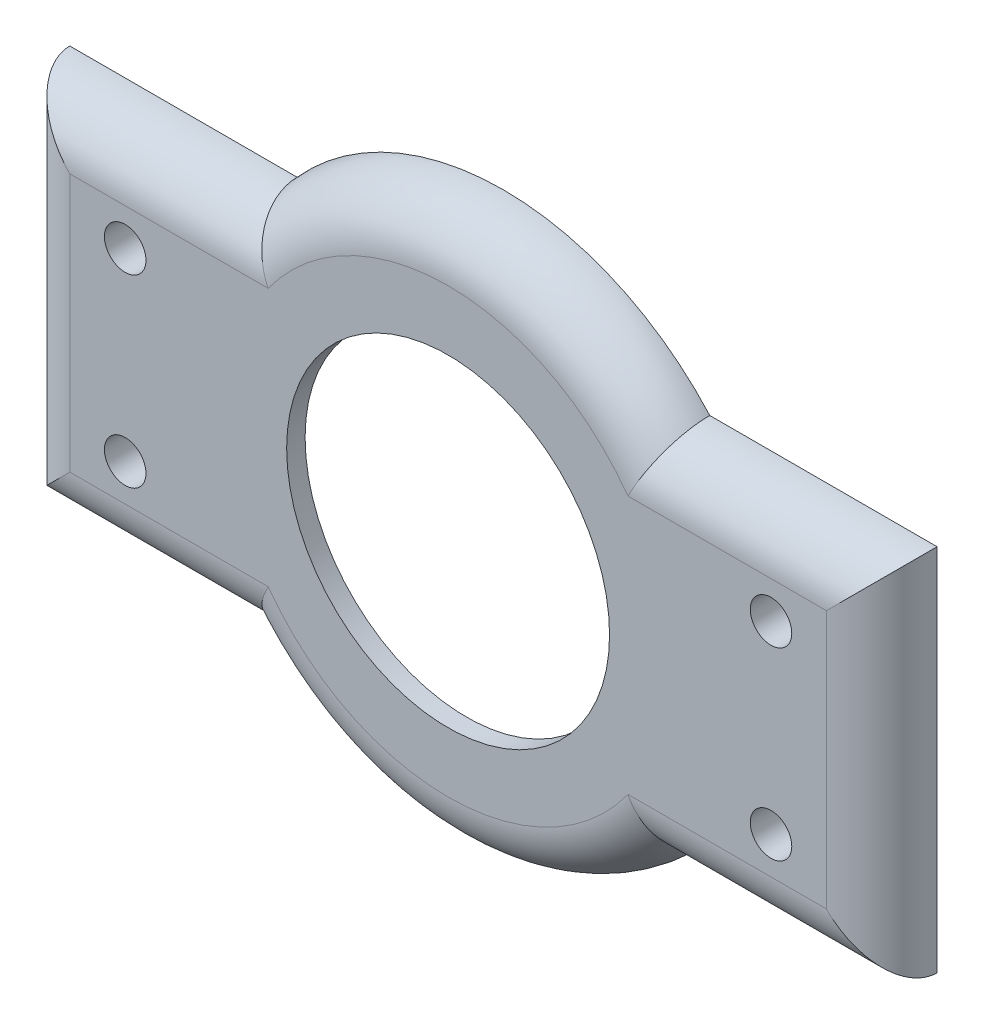
ISO-10303-21;
HEADER;
FILE_DESCRIPTION(('STEP AP214'),'2;1');
FILE_NAME('part.step','',(''),(''),'','','');
FILE_SCHEMA(('AUTOMOTIVE_DESIGN { 1 0 10303 214 1 1 1 1 }'));
ENDSEC;
DATA;
#1=APPLICATION_CONTEXT('core data for automotive mechanical design processes');
#2=APPLICATION_PROTOCOL_DEFINITION('international standard','automotive_design',2000,#1);
#3=PRODUCT_CONTEXT('',#1,'mechanical');
#4=PRODUCT('Part','Part','',(#3));
#5=PRODUCT_RELATED_PRODUCT_CATEGORY('part','',(#4));
#6=PRODUCT_DEFINITION_FORMATION('','',#4);
#7=PRODUCT_DEFINITION_CONTEXT('part definition',#1,'design');
#8=PRODUCT_DEFINITION('design','',#6,#7);
#9=PRODUCT_DEFINITION_SHAPE('','',#8);
#10=(LENGTH_UNIT() NAMED_UNIT(*) SI_UNIT(.MILLI.,.METRE.));
#11=(NAMED_UNIT(*) PLANE_ANGLE_UNIT() SI_UNIT($,.RADIAN.));
#12=(NAMED_UNIT(*) SI_UNIT($,.STERADIAN.) SOLID_ANGLE_UNIT());
#13=UNCERTAINTY_MEASURE_WITH_UNIT(LENGTH_MEASURE(1.E-05),#10,'distance_accuracy_value','');
#14=(GEOMETRIC_REPRESENTATION_CONTEXT(3) GLOBAL_UNCERTAINTY_ASSIGNED_CONTEXT((#13)) GLOBAL_UNIT_ASSIGNED_CONTEXT((#10,
#11,#12)) REPRESENTATION_CONTEXT('',''));
#15=CARTESIAN_POINT('',(0.,0.,0.));
#16=DIRECTION('',(0.,0.,1.));
#17=DIRECTION('',(1.,0.,0.));
#18=AXIS2_PLACEMENT_3D('',#15,#16,#17);
#19=CARTESIAN_POINT('',(0.,0.,2.));
#20=DIRECTION('',(0.,0.,1.));
#21=DIRECTION('',(1.,0.,0.));
#22=AXIS2_PLACEMENT_3D('',#19,#20,#21);
#23=PLANE('',#22);
#24=CARTESIAN_POINT('',(-35.,10.,2.));
#25=DIRECTION('',(0.,0.,1.));
#26=DIRECTION('',(1.,0.,0.));
#27=AXIS2_PLACEMENT_3D('',#24,#25,#26);
#28=CIRCLE('',#27,2.25);
#29=CARTESIAN_POINT('',(-32.75,10.,2.));
#30=VERTEX_POINT('',#29);
#31=EDGE_CURVE('E241',#30,#30,#28,.T.);
#32=ORIENTED_EDGE('',*,*,#31,.F.);
#33=EDGE_LOOP('',(#32));
#34=FACE_BOUND('',#33,.T.);
#35=CARTESIAN_POINT('',(-35.,-10.,2.));
#36=DIRECTION('',(0.,0.,1.));
#37=DIRECTION('',(1.,0.,0.));
#38=AXIS2_PLACEMENT_3D('',#35,#36,#37);
#39=CIRCLE('',#38,2.25);
#40=CARTESIAN_POINT('',(-32.75,-10.,2.));
#41=VERTEX_POINT('',#40);
#42=EDGE_CURVE('E245',#41,#41,#39,.T.);
#43=ORIENTED_EDGE('',*,*,#42,.F.);
#44=EDGE_LOOP('',(#43));
#45=FACE_BOUND('',#44,.T.);
#46=CARTESIAN_POINT('',(35.,10.,2.));
#47=DIRECTION('',(0.,0.,1.));
#48=DIRECTION('',(1.,0.,0.));
#49=AXIS2_PLACEMENT_3D('',#46,#47,#48);
#50=CIRCLE('',#49,2.25);
#51=CARTESIAN_POINT('',(37.25,10.,2.));
#52=VERTEX_POINT('',#51);
#53=EDGE_CURVE('E255',#52,#52,#50,.T.);
#54=ORIENTED_EDGE('',*,*,#53,.F.);
#55=EDGE_LOOP('',(#54));
#56=FACE_BOUND('',#55,.T.);
#57=CARTESIAN_POINT('',(35.,-10.,2.));
#58=DIRECTION('',(0.,0.,1.));
#59=DIRECTION('',(1.,0.,0.));
#60=AXIS2_PLACEMENT_3D('',#57,#58,#59);
#61=CIRCLE('',#60,2.25);
#62=CARTESIAN_POINT('',(37.25,-10.,2.));
#63=VERTEX_POINT('',#62);
#64=EDGE_CURVE('E263',#63,#63,#61,.T.);
#65=ORIENTED_EDGE('',*,*,#64,.F.);
#66=EDGE_LOOP('',(#65));
#67=FACE_BOUND('',#66,.T.);
#68=DIRECTION('',(-1.,0.,0.));
#69=VECTOR('',#68,1.);
#70=CARTESIAN_POINT('',(0.,-14.,2.));
#71=LINE('',#70,#69);
#72=CARTESIAN_POINT('',(19.4935886896179,-14.,2.));
#73=VERTEX_POINT('',#72);
#74=CARTESIAN_POINT('',(41.,-14.,2.));
#75=VERTEX_POINT('',#74);
#76=EDGE_CURVE('E54',#73,#75,#71,.F.);
#77=ORIENTED_EDGE('',*,*,#76,.T.);
#78=DIRECTION('',(0.,-1.,0.));
#79=VECTOR('',#78,1.);
#80=CARTESIAN_POINT('',(41.,0.,2.));
#81=LINE('',#80,#79);
#82=CARTESIAN_POINT('',(41.,14.,2.));
#83=VERTEX_POINT('',#82);
#84=EDGE_CURVE('E11',#75,#83,#81,.F.);
#85=ORIENTED_EDGE('',*,*,#84,.T.);
#86=DIRECTION('',(1.,0.,0.));
#87=VECTOR('',#86,1.);
#88=CARTESIAN_POINT('',(0.,14.,2.));
#89=LINE('',#88,#87);
#90=CARTESIAN_POINT('',(19.4935886896179,14.,2.));
#91=VERTEX_POINT('',#90);
#92=EDGE_CURVE('E309',#83,#91,#89,.F.);
#93=ORIENTED_EDGE('',*,*,#92,.T.);
#94=CARTESIAN_POINT('',(0.,0.,2.));
#95=DIRECTION('',(0.,0.,1.));
#96=DIRECTION('',(1.,0.,0.));
#97=AXIS2_PLACEMENT_3D('',#94,#95,#96);
#98=CIRCLE('',#97,24.);
#99=CARTESIAN_POINT('',(-19.4935886896179,14.,2.));
#100=VERTEX_POINT('',#99);
#101=EDGE_CURVE('E306',#91,#100,#98,.T.);
#102=ORIENTED_EDGE('',*,*,#101,.T.);
#103=DIRECTION('',(1.,0.,0.));
#104=VECTOR('',#103,1.);
#105=CARTESIAN_POINT('',(0.,14.,2.));
#106=LINE('',#105,#104);
#107=CARTESIAN_POINT('',(-41.,14.,2.));
#108=VERTEX_POINT('',#107);
#109=EDGE_CURVE('E295',#100,#108,#106,.F.);
#110=ORIENTED_EDGE('',*,*,#109,.T.);
#111=DIRECTION('',(0.,1.,0.));
#112=VECTOR('',#111,1.);
#113=CARTESIAN_POINT('',(-41.,0.,2.));
#114=LINE('',#113,#112);
#115=CARTESIAN_POINT('',(-41.,-14.,2.));
#116=VERTEX_POINT('',#115);
#117=EDGE_CURVE('E298',#108,#116,#114,.F.);
#118=ORIENTED_EDGE('',*,*,#117,.T.);
#119=DIRECTION('',(-1.,0.,0.));
#120=VECTOR('',#119,1.);
#121=CARTESIAN_POINT('',(0.,-14.,2.));
#122=LINE('',#121,#120);
#123=CARTESIAN_POINT('',(-19.4935886896179,-14.,2.));
#124=VERTEX_POINT('',#123);
#125=EDGE_CURVE('E138',#116,#124,#122,.F.);
#126=ORIENTED_EDGE('',*,*,#125,.T.);
#127=CARTESIAN_POINT('',(0.,0.,2.));
#128=DIRECTION('',(0.,0.,1.));
#129=DIRECTION('',(1.,0.,0.));
#130=AXIS2_PLACEMENT_3D('',#127,#128,#129);
#131=CIRCLE('',#130,24.);
#132=EDGE_CURVE('E303',#124,#73,#131,.T.);
#133=ORIENTED_EDGE('',*,*,#132,.T.);
#134=EDGE_LOOP('',(#77,#85,#93,#102,#110,#118,#126,#133));
#135=FACE_BOUND('',#134,.T.);
#136=CARTESIAN_POINT('',(0.,0.,2.00000000000003));
#137=DIRECTION('',(0.,0.,-1.));
#138=DIRECTION('',(-1.,0.,0.));
#139=AXIS2_PLACEMENT_3D('',#136,#137,#138);
#140=CIRCLE('',#139,17.5);
#141=CARTESIAN_POINT('',(-17.5,0.,2.00000000000003));
#142=VERTEX_POINT('',#141);
#143=EDGE_CURVE('E135',#142,#142,#140,.T.);
#144=ORIENTED_EDGE('',*,*,#143,.T.);
#145=EDGE_LOOP('',(#144));
#146=FACE_BOUND('',#145,.T.);
#147=ADVANCED_FACE('F44',(#34,#45,#56,#67,#135,#146),#23,.T.);
#148=CARTESIAN_POINT('',(0.,0.,-4.));
#149=DIRECTION('',(0.,0.,-1.));
#150=DIRECTION('',(-1.,0.,0.));
#151=AXIS2_PLACEMENT_3D('',#148,#149,#150);
#152=PLANE('',#151);
#153=CARTESIAN_POINT('',(-35.,10.,-4.));
#154=DIRECTION('',(0.,0.,-1.));
#155=DIRECTION('',(-1.,0.,0.));
#156=AXIS2_PLACEMENT_3D('',#153,#154,#155);
#157=CIRCLE('',#156,2.25);
#158=CARTESIAN_POINT('',(-37.25,10.,-4.));
#159=VERTEX_POINT('',#158);
#160=EDGE_CURVE('E238',#159,#159,#157,.T.);
#161=ORIENTED_EDGE('',*,*,#160,.F.);
#162=EDGE_LOOP('',(#161));
#163=FACE_BOUND('',#162,.T.);
#164=CARTESIAN_POINT('',(-35.,-10.,-4.));
#165=DIRECTION('',(0.,0.,-1.));
#166=DIRECTION('',(-1.,0.,0.));
#167=AXIS2_PLACEMENT_3D('',#164,#165,#166);
#168=CIRCLE('',#167,2.25);
#169=CARTESIAN_POINT('',(-37.25,-10.,-4.));
#170=VERTEX_POINT('',#169);
#171=EDGE_CURVE('E251',#170,#170,#168,.T.);
#172=ORIENTED_EDGE('',*,*,#171,.F.);
#173=EDGE_LOOP('',(#172));
#174=FACE_BOUND('',#173,.T.);
#175=CARTESIAN_POINT('',(35.,10.,-4.));
#176=DIRECTION('',(0.,0.,-1.));
#177=DIRECTION('',(-1.,0.,0.));
#178=AXIS2_PLACEMENT_3D('',#175,#176,#177);
#179=CIRCLE('',#178,2.25);
#180=CARTESIAN_POINT('',(32.75,10.,-4.));
#181=VERTEX_POINT('',#180);
#182=EDGE_CURVE('E259',#181,#181,#179,.T.);
#183=ORIENTED_EDGE('',*,*,#182,.F.);
#184=EDGE_LOOP('',(#183));
#185=FACE_BOUND('',#184,.T.);
#186=CARTESIAN_POINT('',(35.,-10.,-4.));
#187=DIRECTION('',(0.,0.,-1.));
#188=DIRECTION('',(-1.,0.,0.));
#189=AXIS2_PLACEMENT_3D('',#186,#187,#188);
#190=CIRCLE('',#189,2.25);
#191=CARTESIAN_POINT('',(32.75,-10.,-4.));
#192=VERTEX_POINT('',#191);
#193=EDGE_CURVE('E267',#192,#192,#190,.T.);
#194=ORIENTED_EDGE('',*,*,#193,.F.);
#195=EDGE_LOOP('',(#194));
#196=FACE_BOUND('',#195,.T.);
#197=CARTESIAN_POINT('',(0.,0.,-4.));
#198=DIRECTION('',(0.,0.,-1.));
#199=DIRECTION('',(-1.,0.,0.));
#200=AXIS2_PLACEMENT_3D('',#197,#198,#199);
#201=CIRCLE('',#200,25.);
#202=CARTESIAN_POINT('',(-25.,0.,-4.));
#203=VERTEX_POINT('',#202);
#204=EDGE_CURVE('E285',#203,#203,#201,.T.);
#205=ORIENTED_EDGE('',*,*,#204,.F.);
#206=EDGE_LOOP('',(#205));
#207=FACE_BOUND('',#206,.T.);
#208=CARTESIAN_POINT('',(0.,0.,-4.));
#209=DIRECTION('',(0.,0.,-1.));
#210=DIRECTION('',(-1.,0.,0.));
#211=AXIS2_PLACEMENT_3D('',#208,#209,#210);
#212=CIRCLE('',#211,30.);
#213=CARTESIAN_POINT('',(-22.3606797749979,20.,-4.));
#214=VERTEX_POINT('',#213);
#215=CARTESIAN_POINT('',(22.3606797749979,20.,-4.));
#216=VERTEX_POINT('',#215);
#217=EDGE_CURVE('E292',#214,#216,#212,.T.);
#218=ORIENTED_EDGE('',*,*,#217,.T.);
#219=DIRECTION('',(1.,0.,0.));
#220=VECTOR('',#219,1.);
#221=CARTESIAN_POINT('',(47.,20.,-4.));
#222=LINE('',#221,#220);
#223=CARTESIAN_POINT('',(47.,20.,-4.));
#224=VERTEX_POINT('',#223);
#225=EDGE_CURVE('E134',#216,#224,#222,.T.);
#226=ORIENTED_EDGE('',*,*,#225,.T.);
#227=DIRECTION('',(0.,-1.,0.));
#228=VECTOR('',#227,1.);
#229=CARTESIAN_POINT('',(47.,-20.,-4.));
#230=LINE('',#229,#228);
#231=CARTESIAN_POINT('',(47.,-20.,-4.));
#232=VERTEX_POINT('',#231);
#233=EDGE_CURVE('E124',#224,#232,#230,.T.);
#234=ORIENTED_EDGE('',*,*,#233,.T.);
#235=DIRECTION('',(-1.,0.,0.));
#236=VECTOR('',#235,1.);
#237=CARTESIAN_POINT('',(47.,-20.,-4.));
#238=LINE('',#237,#236);
#239=CARTESIAN_POINT('',(22.3606797749979,-20.,-4.));
#240=VERTEX_POINT('',#239);
#241=EDGE_CURVE('E123',#232,#240,#238,.T.);
#242=ORIENTED_EDGE('',*,*,#241,.T.);
#243=CARTESIAN_POINT('',(-22.3606797749979,-20.,-4.));
#244=VERTEX_POINT('',#243);
#245=EDGE_CURVE('E117',#240,#244,#212,.T.);
#246=ORIENTED_EDGE('',*,*,#245,.T.);
#247=CARTESIAN_POINT('',(-47.,-20.,-4.));
#248=VERTEX_POINT('',#247);
#249=EDGE_CURVE('E111',#244,#248,#238,.T.);
#250=ORIENTED_EDGE('',*,*,#249,.T.);
#251=DIRECTION('',(0.,1.,0.));
#252=VECTOR('',#251,1.);
#253=CARTESIAN_POINT('',(-47.,-20.,-4.));
#254=LINE('',#253,#252);
#255=CARTESIAN_POINT('',(-47.,20.,-4.));
#256=VERTEX_POINT('',#255);
#257=EDGE_CURVE('E114',#248,#256,#254,.T.);
#258=ORIENTED_EDGE('',*,*,#257,.T.);
#259=EDGE_CURVE('E282',#256,#214,#222,.T.);
#260=ORIENTED_EDGE('',*,*,#259,.T.);
#261=EDGE_LOOP('',(#218,#226,#234,#242,#246,#250,#258,#260));
#262=FACE_BOUND('',#261,.T.);
#263=ADVANCED_FACE('F113',(#163,#174,#185,#196,#207,#262),#152,.T.);
#264=CARTESIAN_POINT('',(0.,0.,-4.));
#265=DIRECTION('',(0.,0.,1.));
#266=DIRECTION('',(1.,0.,0.));
#267=AXIS2_PLACEMENT_3D('',#264,#265,#266);
#268=CYLINDRICAL_SURFACE('',#267,25.);
#269=ORIENTED_EDGE('',*,*,#204,.T.);
#270=EDGE_LOOP('',(#269));
#271=FACE_BOUND('',#270,.T.);
#272=CARTESIAN_POINT('',(0.,0.,0.));
#273=DIRECTION('',(0.,0.,-1.));
#274=DIRECTION('',(-1.,0.,0.));
#275=AXIS2_PLACEMENT_3D('',#272,#273,#274);
#276=CIRCLE('',#275,25.);
#277=CARTESIAN_POINT('',(-25.,0.,0.));
#278=VERTEX_POINT('',#277);
#279=EDGE_CURVE('E278',#278,#278,#276,.T.);
#280=ORIENTED_EDGE('',*,*,#279,.F.);
#281=EDGE_LOOP('',(#280));
#282=FACE_BOUND('',#281,.T.);
#283=ADVANCED_FACE('F205',(#271,#282),#268,.F.);
#284=CARTESIAN_POINT('',(0.,0.,0.));
#285=DIRECTION('',(0.,0.,1.));
#286=DIRECTION('',(1.,0.,0.));
#287=AXIS2_PLACEMENT_3D('',#284,#285,#286);
#288=PLANE('',#287);
#289=CARTESIAN_POINT('',(0.,0.,0.));
#290=DIRECTION('',(0.,0.,-1.));
#291=DIRECTION('',(-1.,0.,0.));
#292=AXIS2_PLACEMENT_3D('',#289,#290,#291);
#293=CIRCLE('',#292,17.5);
#294=CARTESIAN_POINT('',(-17.5,0.,0.));
#295=VERTEX_POINT('',#294);
#296=EDGE_CURVE('E144',#295,#295,#293,.T.);
#297=ORIENTED_EDGE('',*,*,#296,.F.);
#298=EDGE_LOOP('',(#297));
#299=FACE_BOUND('',#298,.T.);
#300=ORIENTED_EDGE('',*,*,#279,.T.);
#301=EDGE_LOOP('',(#300));
#302=FACE_BOUND('',#301,.T.);
#303=ADVANCED_FACE('F201',(#299,#302),#288,.F.);
#304=CARTESIAN_POINT('',(0.,0.,2.00000000000003));
#305=DIRECTION('',(0.,0.,-1.));
#306=DIRECTION('',(-1.,0.,0.));
#307=AXIS2_PLACEMENT_3D('',#304,#305,#306);
#308=CYLINDRICAL_SURFACE('',#307,17.5);
#309=ORIENTED_EDGE('',*,*,#143,.F.);
#310=EDGE_LOOP('',(#309));
#311=FACE_BOUND('',#310,.T.);
#312=ORIENTED_EDGE('',*,*,#296,.T.);
#313=EDGE_LOOP('',(#312));
#314=FACE_BOUND('',#313,.T.);
#315=ADVANCED_FACE('F204',(#311,#314),#308,.F.);
#316=CARTESIAN_POINT('',(-41.,-20.,-4.));
#317=DIRECTION('',(0.,1.,0.));
#318=DIRECTION('',(0.,0.,1.));
#319=AXIS2_PLACEMENT_3D('',#316,#317,#318);
#320=CYLINDRICAL_SURFACE('',#319,6.);
#321=CARTESIAN_POINT('',(-41.,-14.,-4.));
#322=DIRECTION('',(-0.707106781186547,0.707106781186547,0.));
#323=DIRECTION('',(0.707106781186547,0.707106781186547,0.));
#324=AXIS2_PLACEMENT_3D('',#321,#322,#323);
#325=ELLIPSE('',#324,8.48528137423857,6.);
#326=EDGE_CURVE('E129',#116,#248,#325,.F.);
#327=ORIENTED_EDGE('',*,*,#326,.F.);
#328=ORIENTED_EDGE('',*,*,#117,.F.);
#329=CARTESIAN_POINT('',(-41.,14.,-4.));
#330=DIRECTION('',(0.707106781186547,0.707106781186547,0.));
#331=DIRECTION('',(0.707106781186547,-0.707106781186547,0.));
#332=AXIS2_PLACEMENT_3D('',#329,#330,#331);
#333=ELLIPSE('',#332,8.48528137423857,6.);
#334=EDGE_CURVE('E48',#256,#108,#333,.T.);
#335=ORIENTED_EDGE('',*,*,#334,.F.);
#336=ORIENTED_EDGE('',*,*,#257,.F.);
#337=EDGE_LOOP('',(#327,#328,#335,#336));
#338=FACE_BOUND('',#337,.T.);
#339=ADVANCED_FACE('F46',(#338),#320,.T.);
#340=CARTESIAN_POINT('',(47.,14.,-4.));
#341=DIRECTION('',(1.,0.,0.));
#342=DIRECTION('',(0.,0.,-1.));
#343=AXIS2_PLACEMENT_3D('',#340,#341,#342);
#344=CYLINDRICAL_SURFACE('',#343,6.);
#345=ORIENTED_EDGE('',*,*,#334,.T.);
#346=ORIENTED_EDGE('',*,*,#109,.F.);
#347=CARTESIAN_POINT('',(-22.3606797749979,20.,-4.));
#348=CARTESIAN_POINT('',(-22.3606885946868,20.0000246248411,-3.8421552052644));
#349=CARTESIAN_POINT('',(-22.3578946208042,19.9937723539707,-3.68431782060247));
#350=CARTESIAN_POINT('',(-22.3467659816735,19.9688946352079,-3.36984998464221));
#351=CARTESIAN_POINT('',(-22.3384324794666,19.9502717845575,-3.21321928697762));
#352=CARTESIAN_POINT('',(-22.3163215306498,19.9009046069552,-2.9027376627166));
#353=CARTESIAN_POINT('',(-22.3025598394186,19.8701953614595,-2.74888002690595));
#354=CARTESIAN_POINT('',(-22.2697136666972,19.7969937760329,-2.44457447554402));
#355=CARTESIAN_POINT('',(-22.2506290856713,19.7545012157596,-2.29412662381104));
#356=CARTESIAN_POINT('',(-22.2073087006702,19.6582045895661,-1.9977544183201));
#357=CARTESIAN_POINT('',(-22.183075687498,19.6044066521063,-1.85182766272716));
#358=CARTESIAN_POINT('',(-22.1296387585979,19.4860098874083,-1.56530631435557));
#359=CARTESIAN_POINT('',(-22.100432998967,19.4214070538535,-1.42471372322721));
#360=CARTESIAN_POINT('',(-22.0372832655125,19.2820428722381,-1.14977619202819));
#361=CARTESIAN_POINT('',(-22.0033394004845,19.2072817574316,-1.01543110859761));
#362=CARTESIAN_POINT('',(-21.9309502480705,19.0482634156329,-0.753694698315457));
#363=CARTESIAN_POINT('',(-21.8925032521829,18.9640025848766,-0.626306037803511));
#364=CARTESIAN_POINT('',(-21.81006943435,18.783868860479,-0.375192277558907));
#365=CARTESIAN_POINT('',(-21.7659437439989,18.6877087181069,-0.251718583062626));
#366=CARTESIAN_POINT('',(-21.6734924399382,18.4869066812776,-0.0135265858213059));
#367=CARTESIAN_POINT('',(-21.6251653105735,18.3822617268776,0.101188529030902));
#368=CARTESIAN_POINT('',(-21.4743637011181,18.0569107969631,0.431340688345207));
#369=CARTESIAN_POINT('',(-21.3660097099654,17.8246587141122,0.632964134834508));
#370=CARTESIAN_POINT('',(-21.1269204948331,17.3165670418239,1.01087006931773));
#371=CARTESIAN_POINT('',(-20.9950785299177,17.0387148777664,1.18371822278674));
#372=CARTESIAN_POINT('',(-20.719257115299,16.4634300807909,1.48053987909019));
#373=CARTESIAN_POINT('',(-20.5752695448377,16.1659843768813,1.60448036194777));
#374=CARTESIAN_POINT('',(-20.2793743453335,15.5615637855901,1.80189453622453));
#375=CARTESIAN_POINT('',(-20.1275296590345,15.2546707934992,1.87571761250212));
#376=CARTESIAN_POINT('',(-19.8180438644189,14.6365503036601,1.97431545107953));
#377=CARTESIAN_POINT('',(-19.660415129243,14.3253328528119,1.99918933026693));
#378=CARTESIAN_POINT('',(-19.498818843525,14.0101964652727,1.99999351599242));
#379=CARTESIAN_POINT('',(-19.4962039457782,14.0050980649796,2.00000001397718));
#380=CARTESIAN_POINT('',(-19.4935886896179,14.,2.));
#381=B_SPLINE_CURVE_WITH_KNOTS('',3,(#347,#348,#349,#350,#351,#352,#353,#354,#355,#356,#357,
#358,#359,#360,#361,#362,#363,#364,#365,#366,#367,#368,#369,#370,#371,#372,#373,#374,#375,#376,
#377,#378,#379,#380),.UNSPECIFIED.,.F.,.F.,(4,2,2,2,2,2,2,2,2,2,2,2,2,2,2,2,4),(0.,
0.473374539403875,0.946649723740478,1.41856121222911,1.89048152583675,2.36214667602337,
2.83398710288178,3.30581669719329,3.77782588851301,4.26508767936846,4.75252598352504,
5.72672161906379,6.78081230257462,7.83561344195162,8.88298355645046,9.92823066732191,
9.94542026148344),.UNSPECIFIED.);
#382=EDGE_CURVE('E140',#214,#100,#381,.T.);
#383=ORIENTED_EDGE('',*,*,#382,.F.);
#384=ORIENTED_EDGE('',*,*,#259,.F.);
#385=EDGE_LOOP('',(#345,#346,#383,#384));
#386=FACE_BOUND('',#385,.T.);
#387=ADVANCED_FACE('F162',(#386),#344,.T.);
#388=CARTESIAN_POINT('',(47.,-14.,-4.));
#389=DIRECTION('',(-1.,0.,0.));
#390=DIRECTION('',(0.,0.,1.));
#391=AXIS2_PLACEMENT_3D('',#388,#389,#390);
#392=CYLINDRICAL_SURFACE('',#391,6.);
#393=ORIENTED_EDGE('',*,*,#326,.T.);
#394=ORIENTED_EDGE('',*,*,#249,.F.);
#395=CARTESIAN_POINT('',(-22.3606797749979,-20.,-4.));
#396=CARTESIAN_POINT('',(-22.3606885946868,-20.0000246248411,-3.8421552052644));
#397=CARTESIAN_POINT('',(-22.3578946208042,-19.9937723539707,-3.68431782060247));
#398=CARTESIAN_POINT('',(-22.3467659816735,-19.9688946352079,-3.36984998464221));
#399=CARTESIAN_POINT('',(-22.3384324794666,-19.9502717845575,-3.21321928697762));
#400=CARTESIAN_POINT('',(-22.3163215306498,-19.9009046069552,-2.9027376627166));
#401=CARTESIAN_POINT('',(-22.3025598394186,-19.8701953614595,-2.74888002690594));
#402=CARTESIAN_POINT('',(-22.2697136666972,-19.7969937760329,-2.44457447554402));
#403=CARTESIAN_POINT('',(-22.2506290856713,-19.7545012157596,-2.29412662381104));
#404=CARTESIAN_POINT('',(-22.2073087006702,-19.6582045895661,-1.9977544183201));
#405=CARTESIAN_POINT('',(-22.183075687498,-19.6044066521063,-1.85182766272716));
#406=CARTESIAN_POINT('',(-22.1296387585979,-19.4860098874083,-1.56530631435557));
#407=CARTESIAN_POINT('',(-22.100432998967,-19.4214070538535,-1.42471372322721));
#408=CARTESIAN_POINT('',(-22.0372832655125,-19.2820428722381,-1.14977619202819));
#409=CARTESIAN_POINT('',(-22.0033394004845,-19.2072817574316,-1.01543110859761));
#410=CARTESIAN_POINT('',(-21.9309502480705,-19.0482634156329,-0.753694698315458));
#411=CARTESIAN_POINT('',(-21.8925032521829,-18.9640025848766,-0.626306037803511));
#412=CARTESIAN_POINT('',(-21.81006943435,-18.783868860479,-0.375192277558906));
#413=CARTESIAN_POINT('',(-21.7659437439989,-18.6877087181069,-0.251718583062626));
#414=CARTESIAN_POINT('',(-21.6734924399382,-18.4869066812776,-0.0135265858213052));
#415=CARTESIAN_POINT('',(-21.6251653105735,-18.3822617268776,0.101188529030902));
#416=CARTESIAN_POINT('',(-21.4743637011181,-18.0569107969631,0.431340688345207));
#417=CARTESIAN_POINT('',(-21.3660097099654,-17.8246587141122,0.632964134834509));
#418=CARTESIAN_POINT('',(-21.1269204948331,-17.3165670418239,1.01087006931773));
#419=CARTESIAN_POINT('',(-20.9950785299177,-17.0387148777664,1.18371822278674));
#420=CARTESIAN_POINT('',(-20.7192571152989,-16.4634300807909,1.48053987909019));
#421=CARTESIAN_POINT('',(-20.5752695448377,-16.1659843768813,1.60448036194777));
#422=CARTESIAN_POINT('',(-20.2793743453335,-15.5615637855901,1.80189453622453));
#423=CARTESIAN_POINT('',(-20.1275296590345,-15.2546707934992,1.87571761250212));
#424=CARTESIAN_POINT('',(-19.8180438644189,-14.6365503036602,1.97431545107953));
#425=CARTESIAN_POINT('',(-19.6604151292429,-14.325332852812,1.99918933026693));
#426=CARTESIAN_POINT('',(-19.498818843525,-14.0101964652727,1.99999351599242));
#427=CARTESIAN_POINT('',(-19.4962039457782,-14.0050980649796,2.00000001397718));
#428=CARTESIAN_POINT('',(-19.4935886896179,-14.,2.));
#429=B_SPLINE_CURVE_WITH_KNOTS('',3,(#395,#396,#397,#398,#399,#400,#401,#402,#403,#404,#405,
#406,#407,#408,#409,#410,#411,#412,#413,#414,#415,#416,#417,#418,#419,#420,#421,#422,#423,#424,
#425,#426,#427,#428),.UNSPECIFIED.,.F.,.F.,(4,2,2,2,2,2,2,2,2,2,2,2,2,2,2,2,4),(0.,
0.473374539403875,0.946649723740479,1.41856121222912,1.89048152583675,2.36214667602337,
2.83398710288178,3.30581669719328,3.77782588851301,4.26508767936846,4.75252598352504,
5.72672161906379,6.78081230257463,7.83561344195162,8.88298355645046,9.92823066732191,
9.94542026148344),.UNSPECIFIED.);
#430=EDGE_CURVE('E147',#124,#244,#429,.F.);
#431=ORIENTED_EDGE('',*,*,#430,.F.);
#432=ORIENTED_EDGE('',*,*,#125,.F.);
#433=EDGE_LOOP('',(#393,#394,#431,#432));
#434=FACE_BOUND('',#433,.T.);
#435=ADVANCED_FACE('F137',(#434),#392,.T.);
#436=CARTESIAN_POINT('',(0.,0.,-4.));
#437=DIRECTION('',(0.,0.,1.));
#438=DIRECTION('',(1.,0.,0.));
#439=AXIS2_PLACEMENT_3D('',#436,#437,#438);
#440=TOROIDAL_SURFACE('',#439,24.,6.);
#441=ORIENTED_EDGE('',*,*,#382,.T.);
#442=ORIENTED_EDGE('',*,*,#101,.F.);
#443=CARTESIAN_POINT('',(22.3606797749979,20.,-4.));
#444=CARTESIAN_POINT('',(22.3606885946868,20.0000246248411,-3.8421552052644));
#445=CARTESIAN_POINT('',(22.3578946208042,19.9937723539707,-3.68431782060247));
#446=CARTESIAN_POINT('',(22.3467659816735,19.9688946352079,-3.36984998464221));
#447=CARTESIAN_POINT('',(22.3384324794666,19.9502717845575,-3.21321928697762));
#448=CARTESIAN_POINT('',(22.3163215306498,19.9009046069552,-2.9027376627166));
#449=CARTESIAN_POINT('',(22.3025598394186,19.8701953614595,-2.74888002690594));
#450=CARTESIAN_POINT('',(22.2697136666972,19.7969937760329,-2.44457447554402));
#451=CARTESIAN_POINT('',(22.2506290856713,19.7545012157596,-2.29412662381104));
#452=CARTESIAN_POINT('',(22.2073087006702,19.6582045895661,-1.9977544183201));
#453=CARTESIAN_POINT('',(22.183075687498,19.6044066521063,-1.85182766272716));
#454=CARTESIAN_POINT('',(22.1296387585979,19.4860098874083,-1.56530631435557));
#455=CARTESIAN_POINT('',(22.100432998967,19.4214070538535,-1.42471372322721));
#456=CARTESIAN_POINT('',(22.0372832655125,19.2820428722381,-1.14977619202819));
#457=CARTESIAN_POINT('',(22.0033394004845,19.2072817574316,-1.01543110859761));
#458=CARTESIAN_POINT('',(21.9309502480705,19.0482634156329,-0.753694698315458));
#459=CARTESIAN_POINT('',(21.8925032521829,18.9640025848766,-0.626306037803511));
#460=CARTESIAN_POINT('',(21.81006943435,18.783868860479,-0.375192277558906));
#461=CARTESIAN_POINT('',(21.7659437439989,18.6877087181069,-0.251718583062626));
#462=CARTESIAN_POINT('',(21.6734924399382,18.4869066812776,-0.0135265858213052));
#463=CARTESIAN_POINT('',(21.6251653105735,18.3822617268776,0.101188529030902));
#464=CARTESIAN_POINT('',(21.4743637011181,18.0569107969631,0.431340688345207));
#465=CARTESIAN_POINT('',(21.3660097099654,17.8246587141122,0.632964134834509));
#466=CARTESIAN_POINT('',(21.1269204948331,17.3165670418239,1.01087006931773));
#467=CARTESIAN_POINT('',(20.9950785299177,17.0387148777664,1.18371822278674));
#468=CARTESIAN_POINT('',(20.7192571152989,16.4634300807909,1.48053987909019));
#469=CARTESIAN_POINT('',(20.5752695448377,16.1659843768813,1.60448036194777));
#470=CARTESIAN_POINT('',(20.2793743453335,15.5615637855901,1.80189453622453));
#471=CARTESIAN_POINT('',(20.1275296590345,15.2546707934992,1.87571761250212));
#472=CARTESIAN_POINT('',(19.8180438644189,14.6365503036602,1.97431545107953));
#473=CARTESIAN_POINT('',(19.6604151292429,14.325332852812,1.99918933026693));
#474=CARTESIAN_POINT('',(19.498818843525,14.0101964652727,1.99999351599242));
#475=CARTESIAN_POINT('',(19.4962039457782,14.0050980649796,2.00000001397718));
#476=CARTESIAN_POINT('',(19.4935886896179,14.,2.));
#477=B_SPLINE_CURVE_WITH_KNOTS('',3,(#443,#444,#445,#446,#447,#448,#449,#450,#451,#452,#453,
#454,#455,#456,#457,#458,#459,#460,#461,#462,#463,#464,#465,#466,#467,#468,#469,#470,#471,#472,
#473,#474,#475,#476),.UNSPECIFIED.,.F.,.F.,(4,2,2,2,2,2,2,2,2,2,2,2,2,2,2,2,4),(0.,
0.473374539403875,0.946649723740479,1.41856121222912,1.89048152583675,2.36214667602337,
2.83398710288178,3.30581669719328,3.77782588851301,4.26508767936846,4.75252598352504,
5.72672161906379,6.78081230257463,7.83561344195162,8.88298355645046,9.92823066732191,
9.94542026148344),.UNSPECIFIED.);
#478=EDGE_CURVE('E175',#216,#91,#477,.T.);
#479=ORIENTED_EDGE('',*,*,#478,.F.);
#480=ORIENTED_EDGE('',*,*,#217,.F.);
#481=EDGE_LOOP('',(#441,#442,#479,#480));
#482=FACE_BOUND('',#481,.T.);
#483=ADVANCED_FACE('F164',(#482),#440,.T.);
#484=CARTESIAN_POINT('',(0.,0.,-4.));
#485=DIRECTION('',(0.,0.,1.));
#486=DIRECTION('',(1.,0.,0.));
#487=AXIS2_PLACEMENT_3D('',#484,#485,#486);
#488=TOROIDAL_SURFACE('',#487,24.,6.);
#489=ORIENTED_EDGE('',*,*,#430,.T.);
#490=ORIENTED_EDGE('',*,*,#245,.F.);
#491=CARTESIAN_POINT('',(22.3606797749979,-20.,-4.));
#492=CARTESIAN_POINT('',(22.3606885946868,-20.0000246248411,-3.8421552052644));
#493=CARTESIAN_POINT('',(22.3578946208042,-19.9937723539707,-3.68431782060247));
#494=CARTESIAN_POINT('',(22.3467659816735,-19.9688946352079,-3.36984998464221));
#495=CARTESIAN_POINT('',(22.3384324794666,-19.9502717845575,-3.21321928697762));
#496=CARTESIAN_POINT('',(22.3163215306498,-19.9009046069552,-2.9027376627166));
#497=CARTESIAN_POINT('',(22.3025598394186,-19.8701953614595,-2.74888002690594));
#498=CARTESIAN_POINT('',(22.2697136666972,-19.7969937760329,-2.44457447554402));
#499=CARTESIAN_POINT('',(22.2506290856713,-19.7545012157596,-2.29412662381104));
#500=CARTESIAN_POINT('',(22.2073087006702,-19.6582045895661,-1.9977544183201));
#501=CARTESIAN_POINT('',(22.183075687498,-19.6044066521063,-1.85182766272716));
#502=CARTESIAN_POINT('',(22.1296387585979,-19.4860098874083,-1.56530631435557));
#503=CARTESIAN_POINT('',(22.100432998967,-19.4214070538535,-1.42471372322721));
#504=CARTESIAN_POINT('',(22.0372832655125,-19.2820428722381,-1.14977619202819));
#505=CARTESIAN_POINT('',(22.0033394004845,-19.2072817574316,-1.01543110859761));
#506=CARTESIAN_POINT('',(21.9309502480705,-19.0482634156329,-0.753694698315458));
#507=CARTESIAN_POINT('',(21.8925032521829,-18.9640025848766,-0.626306037803511));
#508=CARTESIAN_POINT('',(21.81006943435,-18.783868860479,-0.375192277558906));
#509=CARTESIAN_POINT('',(21.7659437439989,-18.6877087181069,-0.251718583062626));
#510=CARTESIAN_POINT('',(21.6734924399382,-18.4869066812776,-0.0135265858213052));
#511=CARTESIAN_POINT('',(21.6251653105735,-18.3822617268776,0.101188529030902));
#512=CARTESIAN_POINT('',(21.4743637011181,-18.0569107969631,0.431340688345207));
#513=CARTESIAN_POINT('',(21.3660097099654,-17.8246587141122,0.632964134834509));
#514=CARTESIAN_POINT('',(21.1269204948331,-17.3165670418239,1.01087006931773));
#515=CARTESIAN_POINT('',(20.9950785299177,-17.0387148777664,1.18371822278674));
#516=CARTESIAN_POINT('',(20.7192571152989,-16.4634300807909,1.48053987909019));
#517=CARTESIAN_POINT('',(20.5752695448377,-16.1659843768813,1.60448036194777));
#518=CARTESIAN_POINT('',(20.2793743453335,-15.5615637855901,1.80189453622453));
#519=CARTESIAN_POINT('',(20.1275296590345,-15.2546707934992,1.87571761250212));
#520=CARTESIAN_POINT('',(19.8180438644189,-14.6365503036602,1.97431545107953));
#521=CARTESIAN_POINT('',(19.6604151292429,-14.325332852812,1.99918933026693));
#522=CARTESIAN_POINT('',(19.498818843525,-14.0101964652727,1.99999351599242));
#523=CARTESIAN_POINT('',(19.4962039457782,-14.0050980649796,2.00000001397718));
#524=CARTESIAN_POINT('',(19.4935886896179,-14.,2.));
#525=B_SPLINE_CURVE_WITH_KNOTS('',3,(#491,#492,#493,#494,#495,#496,#497,#498,#499,#500,#501,
#502,#503,#504,#505,#506,#507,#508,#509,#510,#511,#512,#513,#514,#515,#516,#517,#518,#519,#520,
#521,#522,#523,#524),.UNSPECIFIED.,.F.,.F.,(4,2,2,2,2,2,2,2,2,2,2,2,2,2,2,2,4),(0.,
0.473374539403875,0.946649723740479,1.41856121222912,1.89048152583675,2.36214667602337,
2.83398710288178,3.30581669719328,3.77782588851301,4.26508767936846,4.75252598352504,
5.72672161906379,6.78081230257463,7.83561344195162,8.88298355645046,9.92823066732191,
9.94542026148344),.UNSPECIFIED.);
#526=EDGE_CURVE('E183',#73,#240,#525,.F.);
#527=ORIENTED_EDGE('',*,*,#526,.F.);
#528=ORIENTED_EDGE('',*,*,#132,.F.);
#529=EDGE_LOOP('',(#489,#490,#527,#528));
#530=FACE_BOUND('',#529,.T.);
#531=ADVANCED_FACE('F168',(#530),#488,.T.);
#532=CARTESIAN_POINT('',(47.,14.,-4.));
#533=DIRECTION('',(1.,0.,0.));
#534=DIRECTION('',(0.,0.,-1.));
#535=AXIS2_PLACEMENT_3D('',#532,#533,#534);
#536=CYLINDRICAL_SURFACE('',#535,6.);
#537=ORIENTED_EDGE('',*,*,#478,.T.);
#538=ORIENTED_EDGE('',*,*,#92,.F.);
#539=CARTESIAN_POINT('',(41.,14.,-4.));
#540=DIRECTION('',(0.707106781186547,-0.707106781186547,0.));
#541=DIRECTION('',(0.707106781186547,0.707106781186547,0.));
#542=AXIS2_PLACEMENT_3D('',#539,#540,#541);
#543=ELLIPSE('',#542,8.48528137423857,6.);
#544=EDGE_CURVE('E67',#224,#83,#543,.T.);
#545=ORIENTED_EDGE('',*,*,#544,.F.);
#546=ORIENTED_EDGE('',*,*,#225,.F.);
#547=EDGE_LOOP('',(#537,#538,#545,#546));
#548=FACE_BOUND('',#547,.T.);
#549=ADVANCED_FACE('F172',(#548),#536,.T.);
#550=CARTESIAN_POINT('',(47.,-14.,-4.));
#551=DIRECTION('',(-1.,0.,0.));
#552=DIRECTION('',(0.,0.,1.));
#553=AXIS2_PLACEMENT_3D('',#550,#551,#552);
#554=CYLINDRICAL_SURFACE('',#553,6.);
#555=ORIENTED_EDGE('',*,*,#526,.T.);
#556=ORIENTED_EDGE('',*,*,#241,.F.);
#557=CARTESIAN_POINT('',(41.,-14.,-4.));
#558=DIRECTION('',(-0.707106781186547,-0.707106781186547,0.));
#559=DIRECTION('',(-0.707106781186547,0.707106781186547,0.));
#560=AXIS2_PLACEMENT_3D('',#557,#558,#559);
#561=ELLIPSE('',#560,8.48528137423857,6.);
#562=EDGE_CURVE('E271',#75,#232,#561,.F.);
#563=ORIENTED_EDGE('',*,*,#562,.F.);
#564=ORIENTED_EDGE('',*,*,#76,.F.);
#565=EDGE_LOOP('',(#555,#556,#563,#564));
#566=FACE_BOUND('',#565,.T.);
#567=ADVANCED_FACE('F192',(#566),#554,.T.);
#568=CARTESIAN_POINT('',(41.,-20.,-4.));
#569=DIRECTION('',(0.,-1.,0.));
#570=DIRECTION('',(0.,0.,-1.));
#571=AXIS2_PLACEMENT_3D('',#568,#569,#570);
#572=CYLINDRICAL_SURFACE('',#571,6.);
#573=ORIENTED_EDGE('',*,*,#544,.T.);
#574=ORIENTED_EDGE('',*,*,#84,.F.);
#575=ORIENTED_EDGE('',*,*,#562,.T.);
#576=ORIENTED_EDGE('',*,*,#233,.F.);
#577=EDGE_LOOP('',(#573,#574,#575,#576));
#578=FACE_BOUND('',#577,.T.);
#579=ADVANCED_FACE('F196',(#578),#572,.T.);
#580=CARTESIAN_POINT('',(35.,-10.,2.));
#581=DIRECTION('',(0.,0.,1.));
#582=DIRECTION('',(1.,0.,0.));
#583=AXIS2_PLACEMENT_3D('',#580,#581,#582);
#584=CYLINDRICAL_SURFACE('',#583,2.25);
#585=ORIENTED_EDGE('',*,*,#193,.T.);
#586=EDGE_LOOP('',(#585));
#587=FACE_BOUND('',#586,.T.);
#588=ORIENTED_EDGE('',*,*,#64,.T.);
#589=EDGE_LOOP('',(#588));
#590=FACE_BOUND('',#589,.T.);
#591=ADVANCED_FACE('F200',(#587,#590),#584,.F.);
#592=CARTESIAN_POINT('',(35.,10.,2.));
#593=DIRECTION('',(0.,0.,1.));
#594=DIRECTION('',(1.,0.,0.));
#595=AXIS2_PLACEMENT_3D('',#592,#593,#594);
#596=CYLINDRICAL_SURFACE('',#595,2.25);
#597=ORIENTED_EDGE('',*,*,#182,.T.);
#598=EDGE_LOOP('',(#597));
#599=FACE_BOUND('',#598,.T.);
#600=ORIENTED_EDGE('',*,*,#53,.T.);
#601=EDGE_LOOP('',(#600));
#602=FACE_BOUND('',#601,.T.);
#603=ADVANCED_FACE('F221',(#599,#602),#596,.F.);
#604=CARTESIAN_POINT('',(-35.,-10.,2.));
#605=DIRECTION('',(0.,0.,1.));
#606=DIRECTION('',(1.,0.,0.));
#607=AXIS2_PLACEMENT_3D('',#604,#605,#606);
#608=CYLINDRICAL_SURFACE('',#607,2.25);
#609=ORIENTED_EDGE('',*,*,#171,.T.);
#610=EDGE_LOOP('',(#609));
#611=FACE_BOUND('',#610,.T.);
#612=ORIENTED_EDGE('',*,*,#42,.T.);
#613=EDGE_LOOP('',(#612));
#614=FACE_BOUND('',#613,.T.);
#615=ADVANCED_FACE('F225',(#611,#614),#608,.F.);
#616=CARTESIAN_POINT('',(-35.,10.,2.));
#617=DIRECTION('',(0.,0.,1.));
#618=DIRECTION('',(1.,0.,0.));
#619=AXIS2_PLACEMENT_3D('',#616,#617,#618);
#620=CYLINDRICAL_SURFACE('',#619,2.25);
#621=ORIENTED_EDGE('',*,*,#160,.T.);
#622=EDGE_LOOP('',(#621));
#623=FACE_BOUND('',#622,.T.);
#624=ORIENTED_EDGE('',*,*,#31,.T.);
#625=EDGE_LOOP('',(#624));
#626=FACE_BOUND('',#625,.T.);
#627=ADVANCED_FACE('F229',(#623,#626),#620,.F.);
#628=CLOSED_SHELL('',(#147,#263,#283,#303,#315,#339,#387,#435,#483,#531,#549,#567,#579,#591,
#603,#615,#627));
#629=MANIFOLD_SOLID_BREP('B2',#628);
#630=ADVANCED_BREP_SHAPE_REPRESENTATION('',(#18,#629),#14);
#631=SHAPE_DEFINITION_REPRESENTATION(#9,#630);
ENDSEC;
END-ISO-10303-21;
